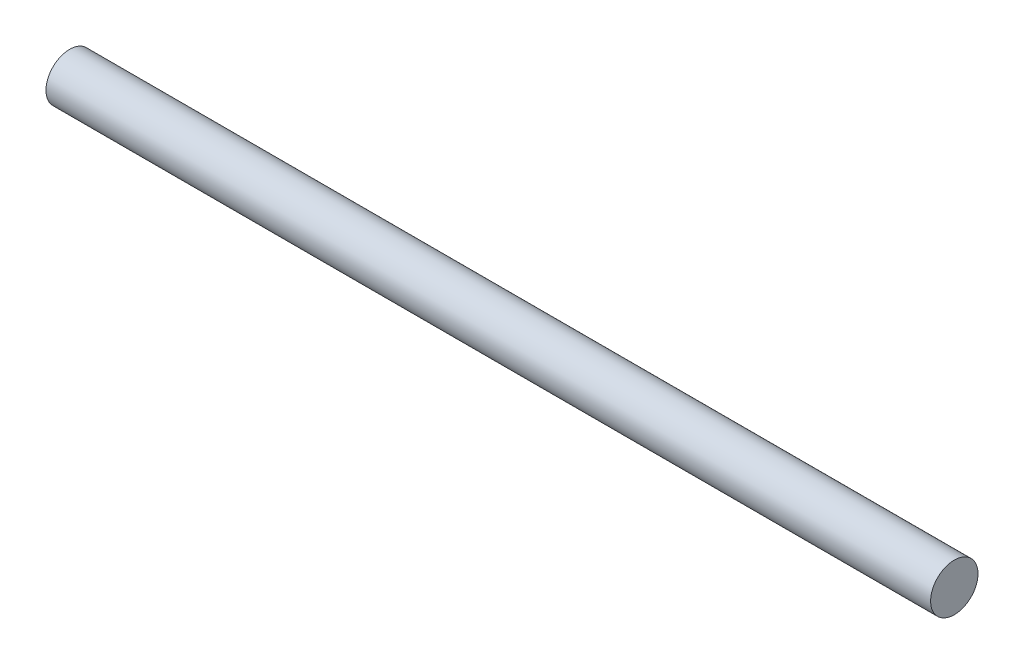
ISO-10303-21;
HEADER;
FILE_DESCRIPTION(('STEP AP214'),'2;1');
FILE_NAME('part.step','',(''),(''),'','','');
FILE_SCHEMA(('AUTOMOTIVE_DESIGN { 1 0 10303 214 1 1 1 1 }'));
ENDSEC;
DATA;
#1=APPLICATION_CONTEXT('core data for automotive mechanical design processes');
#2=APPLICATION_PROTOCOL_DEFINITION('international standard','automotive_design',2000,#1);
#3=PRODUCT_CONTEXT('',#1,'mechanical');
#4=PRODUCT('Part','Part','',(#3));
#5=PRODUCT_RELATED_PRODUCT_CATEGORY('part','',(#4));
#6=PRODUCT_DEFINITION_FORMATION('','',#4);
#7=PRODUCT_DEFINITION_CONTEXT('part definition',#1,'design');
#8=PRODUCT_DEFINITION('design','',#6,#7);
#9=PRODUCT_DEFINITION_SHAPE('','',#8);
#10=(LENGTH_UNIT() NAMED_UNIT(*) SI_UNIT(.MILLI.,.METRE.));
#11=(NAMED_UNIT(*) PLANE_ANGLE_UNIT() SI_UNIT($,.RADIAN.));
#12=(NAMED_UNIT(*) SI_UNIT($,.STERADIAN.) SOLID_ANGLE_UNIT());
#13=UNCERTAINTY_MEASURE_WITH_UNIT(LENGTH_MEASURE(1.E-05),#10,'distance_accuracy_value','');
#14=(GEOMETRIC_REPRESENTATION_CONTEXT(3) GLOBAL_UNCERTAINTY_ASSIGNED_CONTEXT((#13)) GLOBAL_UNIT_ASSIGNED_CONTEXT((#10,
#11,#12)) REPRESENTATION_CONTEXT('',''));
#15=CARTESIAN_POINT('',(0.,0.,0.));
#16=DIRECTION('',(0.,0.,1.));
#17=DIRECTION('',(1.,0.,0.));
#18=AXIS2_PLACEMENT_3D('',#15,#16,#17);
#19=CARTESIAN_POINT('',(560.,0.,0.));
#20=DIRECTION('',(-1.,0.,0.));
#21=DIRECTION('',(0.,0.,1.));
#22=AXIS2_PLACEMENT_3D('',#19,#20,#21);
#23=CYLINDRICAL_SURFACE('',#22,15.);
#24=CARTESIAN_POINT('',(560.,0.,0.));
#25=DIRECTION('',(1.,0.,0.));
#26=DIRECTION('',(0.,0.,-1.));
#27=AXIS2_PLACEMENT_3D('',#24,#25,#26);
#28=CIRCLE('',#27,15.);
#29=CARTESIAN_POINT('',(560.,0.,-15.));
#30=VERTEX_POINT('',#29);
#31=EDGE_CURVE('E10',#30,#30,#28,.T.);
#32=ORIENTED_EDGE('',*,*,#31,.F.);
#33=EDGE_LOOP('',(#32));
#34=FACE_BOUND('',#33,.T.);
#35=CARTESIAN_POINT('',(0.,0.,0.));
#36=DIRECTION('',(1.,0.,0.));
#37=DIRECTION('',(0.,0.,-1.));
#38=AXIS2_PLACEMENT_3D('',#35,#36,#37);
#39=CIRCLE('',#38,15.);
#40=CARTESIAN_POINT('',(0.,0.,-15.));
#41=VERTEX_POINT('',#40);
#42=EDGE_CURVE('E44',#41,#41,#39,.T.);
#43=ORIENTED_EDGE('',*,*,#42,.T.);
#44=EDGE_LOOP('',(#43));
#45=FACE_BOUND('',#44,.T.);
#46=ADVANCED_FACE('F41',(#34,#45),#23,.T.);
#47=CARTESIAN_POINT('',(560.,0.,0.));
#48=DIRECTION('',(1.,0.,0.));
#49=DIRECTION('',(0.,0.,-1.));
#50=AXIS2_PLACEMENT_3D('',#47,#48,#49);
#51=PLANE('',#50);
#52=ORIENTED_EDGE('',*,*,#31,.T.);
#53=EDGE_LOOP('',(#52));
#54=FACE_BOUND('',#53,.T.);
#55=ADVANCED_FACE('F56',(#54),#51,.T.);
#56=CARTESIAN_POINT('',(0.,0.,0.));
#57=DIRECTION('',(1.,0.,0.));
#58=DIRECTION('',(0.,0.,-1.));
#59=AXIS2_PLACEMENT_3D('',#56,#57,#58);
#60=PLANE('',#59);
#61=ORIENTED_EDGE('',*,*,#42,.F.);
#62=EDGE_LOOP('',(#61));
#63=FACE_BOUND('',#62,.T.);
#64=ADVANCED_FACE('F54',(#63),#60,.F.);
#65=CLOSED_SHELL('',(#46,#55,#64));
#66=MANIFOLD_SOLID_BREP('B2',#65);
#67=ADVANCED_BREP_SHAPE_REPRESENTATION('',(#18,#66),#14);
#68=SHAPE_DEFINITION_REPRESENTATION(#9,#67);
ENDSEC;
END-ISO-10303-21;
